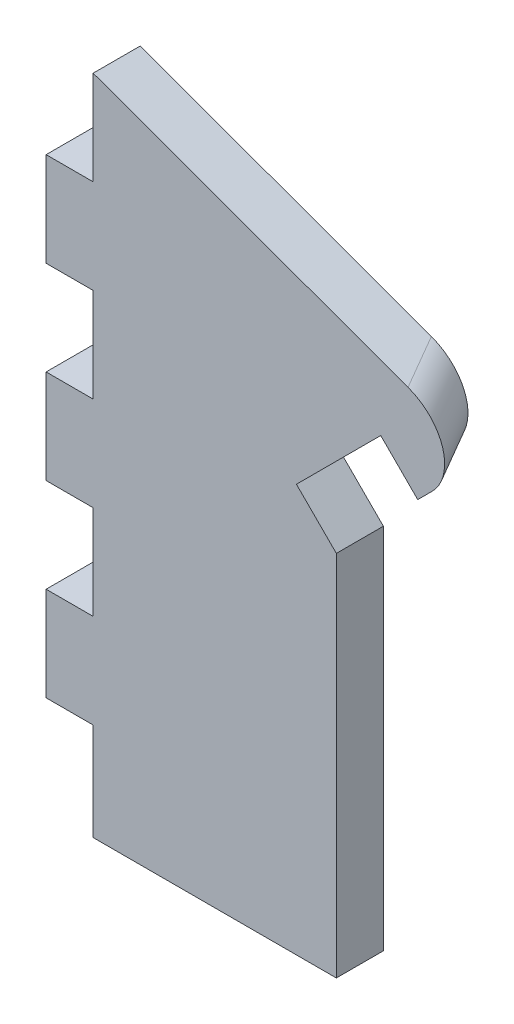
ISO-10303-21;
HEADER;
FILE_DESCRIPTION(('STEP AP214'),'2;1');
FILE_NAME('part.step','',(''),(''),'','','');
FILE_SCHEMA(('AUTOMOTIVE_DESIGN { 1 0 10303 214 1 1 1 1 }'));
ENDSEC;
DATA;
#1=APPLICATION_CONTEXT('core data for automotive mechanical design processes');
#2=APPLICATION_PROTOCOL_DEFINITION('international standard','automotive_design',2000,#1);
#3=PRODUCT_CONTEXT('',#1,'mechanical');
#4=PRODUCT('Part','Part','',(#3));
#5=PRODUCT_RELATED_PRODUCT_CATEGORY('part','',(#4));
#6=PRODUCT_DEFINITION_FORMATION('','',#4);
#7=PRODUCT_DEFINITION_CONTEXT('part definition',#1,'design');
#8=PRODUCT_DEFINITION('design','',#6,#7);
#9=PRODUCT_DEFINITION_SHAPE('','',#8);
#10=(LENGTH_UNIT() NAMED_UNIT(*) SI_UNIT(.MILLI.,.METRE.));
#11=(NAMED_UNIT(*) PLANE_ANGLE_UNIT() SI_UNIT($,.RADIAN.));
#12=(NAMED_UNIT(*) SI_UNIT($,.STERADIAN.) SOLID_ANGLE_UNIT());
#13=UNCERTAINTY_MEASURE_WITH_UNIT(LENGTH_MEASURE(1.E-05),#10,'distance_accuracy_value','');
#14=(GEOMETRIC_REPRESENTATION_CONTEXT(3) GLOBAL_UNCERTAINTY_ASSIGNED_CONTEXT((#13)) GLOBAL_UNIT_ASSIGNED_CONTEXT((#10,
#11,#12)) REPRESENTATION_CONTEXT('',''));
#15=CARTESIAN_POINT('',(0.,0.,0.));
#16=DIRECTION('',(0.,0.,1.));
#17=DIRECTION('',(1.,0.,0.));
#18=AXIS2_PLACEMENT_3D('',#15,#16,#17);
#19=CARTESIAN_POINT('',(0.,140.724589222245,10.));
#20=DIRECTION('',(0.,0.,-1.));
#21=DIRECTION('',(-1.,0.,0.));
#22=AXIS2_PLACEMENT_3D('',#19,#20,#21);
#23=PLANE('',#22);
#24=DIRECTION('',(-0.707020674127324,-0.707192877761467,0.));
#25=VECTOR('',#24,1.);
#26=CARTESIAN_POINT('',(61.5105859152018,79.2289813233183,10.));
#27=LINE('',#26,#25);
#28=CARTESIAN_POINT('',(82.0807535358215,99.8041590628056,10.));
#29=VERTEX_POINT('',#28);
#30=CARTESIAN_POINT('',(78.9949732784198,96.7176272254375,10.));
#31=VERTEX_POINT('',#30);
#32=EDGE_CURVE('E185',#29,#31,#27,.T.);
#33=ORIENTED_EDGE('',*,*,#32,.F.);
#34=CARTESIAN_POINT('',(73.5157746309853,106.964960125446,10.));
#35=DIRECTION('',(0.,0.,-1.));
#36=DIRECTION('',(-0.939692620785907,0.342020143325672,0.));
#37=AXIS2_PLACEMENT_3D('',#34,#35,#36);
#38=ELLIPSE('',#37,11.3486836050021,10.);
#39=CARTESIAN_POINT('',(76.935976064242,116.361886333305,10.));
#40=VERTEX_POINT('',#39);
#41=EDGE_CURVE('E55',#29,#40,#38,.F.);
#42=ORIENTED_EDGE('',*,*,#41,.T.);
#43=DIRECTION('',(0.939692620785907,-0.342020143325673,0.));
#44=VECTOR('',#43,1.);
#45=CARTESIAN_POINT('',(10.,140.724589222245,10.));
#46=LINE('',#45,#44);
#47=CARTESIAN_POINT('',(10.,140.724589222245,10.));
#48=VERTEX_POINT('',#47);
#49=EDGE_CURVE('E217',#48,#40,#46,.T.);
#50=ORIENTED_EDGE('',*,*,#49,.F.);
#51=DIRECTION('',(0.,1.,0.));
#52=VECTOR('',#51,1.);
#53=CARTESIAN_POINT('',(10.,120.724589222245,10.));
#54=LINE('',#53,#52);
#55=CARTESIAN_POINT('',(10.,120.724589222245,10.));
#56=VERTEX_POINT('',#55);
#57=EDGE_CURVE('E230',#56,#48,#54,.T.);
#58=ORIENTED_EDGE('',*,*,#57,.F.);
#59=DIRECTION('',(1.,0.,0.));
#60=VECTOR('',#59,1.);
#61=CARTESIAN_POINT('',(0.,120.724589222245,10.));
#62=LINE('',#61,#60);
#63=CARTESIAN_POINT('',(0.,120.724589222245,10.));
#64=VERTEX_POINT('',#63);
#65=EDGE_CURVE('E233',#64,#56,#62,.T.);
#66=ORIENTED_EDGE('',*,*,#65,.F.);
#67=DIRECTION('',(0.,-1.,0.));
#68=VECTOR('',#67,1.);
#69=CARTESIAN_POINT('',(0.,0.,10.));
#70=LINE('',#69,#68);
#71=CARTESIAN_POINT('',(0.,100.724589222245,10.));
#72=VERTEX_POINT('',#71);
#73=EDGE_CURVE('E313',#64,#72,#70,.T.);
#74=ORIENTED_EDGE('',*,*,#73,.T.);
#75=DIRECTION('',(-1.,0.,0.));
#76=VECTOR('',#75,1.);
#77=CARTESIAN_POINT('',(59.5721644797323,100.724589222245,10.));
#78=LINE('',#77,#76);
#79=CARTESIAN_POINT('',(10.,100.724589222245,10.));
#80=VERTEX_POINT('',#79);
#81=EDGE_CURVE('E271',#80,#72,#78,.T.);
#82=ORIENTED_EDGE('',*,*,#81,.F.);
#83=DIRECTION('',(0.,1.,0.));
#84=VECTOR('',#83,1.);
#85=CARTESIAN_POINT('',(10.,-73.1990088628228,10.));
#86=LINE('',#85,#84);
#87=CARTESIAN_POINT('',(10.,80.7245892222448,10.));
#88=VERTEX_POINT('',#87);
#89=EDGE_CURVE('E275',#88,#80,#86,.T.);
#90=ORIENTED_EDGE('',*,*,#89,.F.);
#91=DIRECTION('',(1.,0.,0.));
#92=VECTOR('',#91,1.);
#93=CARTESIAN_POINT('',(59.5721644797323,80.7245892222448,10.));
#94=LINE('',#93,#92);
#95=CARTESIAN_POINT('',(0.,80.7245892222448,10.));
#96=VERTEX_POINT('',#95);
#97=EDGE_CURVE('E268',#96,#88,#94,.T.);
#98=ORIENTED_EDGE('',*,*,#97,.F.);
#99=CARTESIAN_POINT('',(0.,60.7245892222449,10.));
#100=VERTEX_POINT('',#99);
#101=EDGE_CURVE('E316',#96,#100,#70,.T.);
#102=ORIENTED_EDGE('',*,*,#101,.T.);
#103=DIRECTION('',(-1.,0.,0.));
#104=VECTOR('',#103,1.);
#105=CARTESIAN_POINT('',(59.5721644797323,60.7245892222449,10.));
#106=LINE('',#105,#104);
#107=CARTESIAN_POINT('',(10.,60.7245892222448,10.));
#108=VERTEX_POINT('',#107);
#109=EDGE_CURVE('E299',#108,#100,#106,.T.);
#110=ORIENTED_EDGE('',*,*,#109,.F.);
#111=DIRECTION('',(0.,1.,0.));
#112=VECTOR('',#111,1.);
#113=CARTESIAN_POINT('',(10.,-73.1990088628228,10.));
#114=LINE('',#113,#112);
#115=CARTESIAN_POINT('',(10.,40.7245892222448,10.));
#116=VERTEX_POINT('',#115);
#117=EDGE_CURVE('E278',#116,#108,#114,.T.);
#118=ORIENTED_EDGE('',*,*,#117,.F.);
#119=DIRECTION('',(1.,0.,0.));
#120=VECTOR('',#119,1.);
#121=CARTESIAN_POINT('',(59.5721644797323,40.7245892222448,10.));
#122=LINE('',#121,#120);
#123=CARTESIAN_POINT('',(0.,40.7245892222448,10.));
#124=VERTEX_POINT('',#123);
#125=EDGE_CURVE('E290',#124,#116,#122,.T.);
#126=ORIENTED_EDGE('',*,*,#125,.F.);
#127=CARTESIAN_POINT('',(0.,20.7245892222448,10.));
#128=VERTEX_POINT('',#127);
#129=EDGE_CURVE('E317',#124,#128,#70,.T.);
#130=ORIENTED_EDGE('',*,*,#129,.T.);
#131=DIRECTION('',(1.,0.,0.));
#132=VECTOR('',#131,1.);
#133=CARTESIAN_POINT('',(59.5721644797322,20.7245892222448,10.));
#134=LINE('',#133,#132);
#135=CARTESIAN_POINT('',(10.,20.7245892222448,10.));
#136=VERTEX_POINT('',#135);
#137=EDGE_CURVE('E249',#128,#136,#134,.T.);
#138=ORIENTED_EDGE('',*,*,#137,.T.);
#139=DIRECTION('',(0.,-1.,0.));
#140=VECTOR('',#139,1.);
#141=CARTESIAN_POINT('',(10.,-73.1990088628228,10.));
#142=LINE('',#141,#140);
#143=CARTESIAN_POINT('',(10.,0.,10.));
#144=VERTEX_POINT('',#143);
#145=EDGE_CURVE('E252',#136,#144,#142,.T.);
#146=ORIENTED_EDGE('',*,*,#145,.T.);
#147=DIRECTION('',(1.,0.,0.));
#148=VECTOR('',#147,1.);
#149=CARTESIAN_POINT('',(0.,0.,10.));
#150=LINE('',#149,#148);
#151=CARTESIAN_POINT('',(61.6966708086558,0.,10.));
#152=VERTEX_POINT('',#151);
#153=EDGE_CURVE('E315',#144,#152,#150,.T.);
#154=ORIENTED_EDGE('',*,*,#153,.T.);
#155=DIRECTION('',(0.,-1.,0.));
#156=VECTOR('',#155,1.);
#157=CARTESIAN_POINT('',(61.6966708086558,78.1703480445436,10.));
#158=LINE('',#157,#156);
#159=CARTESIAN_POINT('',(61.6966708086558,78.1703480445436,10.));
#160=VERTEX_POINT('',#159);
#161=EDGE_CURVE('E210',#160,#152,#158,.T.);
#162=ORIENTED_EDGE('',*,*,#161,.F.);
#163=DIRECTION('',(0.707192877761467,-0.707020674127324,0.));
#164=VECTOR('',#163,1.);
#165=CARTESIAN_POINT('',(31.1419879340853,108.717590760147,10.));
#166=LINE('',#165,#164);
#167=CARTESIAN_POINT('',(53.2103562755182,86.6545961340715,10.));
#168=VERTEX_POINT('',#167);
#169=EDGE_CURVE('E205',#168,#160,#166,.T.);
#170=ORIENTED_EDGE('',*,*,#169,.F.);
#171=DIRECTION('',(0.707020674127323,0.707192877761467,0.));
#172=VECTOR('',#171,1.);
#173=CARTESIAN_POINT('',(53.2103562755182,86.6545961340715,10.));
#174=LINE('',#173,#172);
#175=CARTESIAN_POINT('',(71.1310404745797,104.579645137527,10.));
#176=VERTEX_POINT('',#175);
#177=EDGE_CURVE('E335',#168,#176,#174,.T.);
#178=ORIENTED_EDGE('',*,*,#177,.T.);
#179=DIRECTION('',(0.707192877761467,-0.707020674127324,0.));
#180=VECTOR('',#179,1.);
#181=CARTESIAN_POINT('',(49.0626721331468,126.642639763603,10.));
#182=LINE('',#181,#180);
#183=EDGE_CURVE('E200',#176,#31,#182,.T.);
#184=ORIENTED_EDGE('',*,*,#183,.T.);
#185=EDGE_LOOP('',(#33,#42,#50,#58,#66,#74,#82,#90,#98,#102,#110,#118,#126,#130,#138,#146,#154,
#162,#170,#178,#184));
#186=FACE_BOUND('',#185,.T.);
#187=ADVANCED_FACE('F33',(#186),#23,.F.);
#188=CARTESIAN_POINT('',(0.,140.724589222245,0.));
#189=DIRECTION('',(0.,0.,-1.));
#190=DIRECTION('',(-1.,0.,0.));
#191=AXIS2_PLACEMENT_3D('',#188,#189,#190);
#192=PLANE('',#191);
#193=DIRECTION('',(0.939692620785907,-0.342020143325673,0.));
#194=VECTOR('',#193,1.);
#195=CARTESIAN_POINT('',(10.,140.724589222245,0.));
#196=LINE('',#195,#194);
#197=CARTESIAN_POINT('',(10.,140.724589222245,0.));
#198=VERTEX_POINT('',#197);
#199=CARTESIAN_POINT('',(71.8937024804231,118.197123830842,0.));
#200=VERTEX_POINT('',#199);
#201=EDGE_CURVE('E220',#198,#200,#196,.T.);
#202=ORIENTED_EDGE('',*,*,#201,.T.);
#203=CARTESIAN_POINT('',(68.4735010471663,108.800197622983,0.));
#204=DIRECTION('',(0.,0.,-1.));
#205=DIRECTION('',(-0.939692620785907,0.342020143325672,0.));
#206=AXIS2_PLACEMENT_3D('',#203,#204,#205);
#207=ELLIPSE('',#206,11.3486836050021,10.);
#208=CARTESIAN_POINT('',(77.0384799520025,101.639396560342,0.));
#209=VERTEX_POINT('',#208);
#210=EDGE_CURVE('E11',#200,#209,#207,.T.);
#211=ORIENTED_EDGE('',*,*,#210,.T.);
#212=DIRECTION('',(-0.707020674127324,-0.707192877761467,0.));
#213=VECTOR('',#212,1.);
#214=CARTESIAN_POINT('',(58.071216422452,82.6675133190508,0.));
#215=LINE('',#214,#213);
#216=CARTESIAN_POINT('',(75.55560378567,100.15615922117,0.));
#217=VERTEX_POINT('',#216);
#218=EDGE_CURVE('E175',#209,#217,#215,.T.);
#219=ORIENTED_EDGE('',*,*,#218,.T.);
#220=DIRECTION('',(0.707192877761467,-0.707020674127324,0.));
#221=VECTOR('',#220,1.);
#222=CARTESIAN_POINT('',(49.0626721331468,126.642639763603,0.));
#223=LINE('',#222,#221);
#224=CARTESIAN_POINT('',(67.6916709818298,108.01817713326,0.));
#225=VERTEX_POINT('',#224);
#226=EDGE_CURVE('E180',#225,#217,#223,.T.);
#227=ORIENTED_EDGE('',*,*,#226,.F.);
#228=DIRECTION('',(-0.707020674127323,-0.707192877761467,0.));
#229=VECTOR('',#228,1.);
#230=CARTESIAN_POINT('',(49.7709867827684,90.093128129804,0.));
#231=LINE('',#230,#229);
#232=CARTESIAN_POINT('',(49.7709867827684,90.0931281298039,0.));
#233=VERTEX_POINT('',#232);
#234=EDGE_CURVE('E213',#225,#233,#231,.T.);
#235=ORIENTED_EDGE('',*,*,#234,.T.);
#236=DIRECTION('',(0.707192877761467,-0.707020674127324,0.));
#237=VECTOR('',#236,1.);
#238=CARTESIAN_POINT('',(31.1419879340853,108.717590760147,0.));
#239=LINE('',#238,#237);
#240=CARTESIAN_POINT('',(61.6966708086558,78.1703480445436,0.));
#241=VERTEX_POINT('',#240);
#242=EDGE_CURVE('E199',#233,#241,#239,.T.);
#243=ORIENTED_EDGE('',*,*,#242,.T.);
#244=DIRECTION('',(0.,1.,0.));
#245=VECTOR('',#244,1.);
#246=CARTESIAN_POINT('',(61.6966708086558,140.724589222245,0.));
#247=LINE('',#246,#245);
#248=CARTESIAN_POINT('',(61.6966708086558,0.,0.));
#249=VERTEX_POINT('',#248);
#250=EDGE_CURVE('E194',#249,#241,#247,.T.);
#251=ORIENTED_EDGE('',*,*,#250,.F.);
#252=DIRECTION('',(1.,0.,0.));
#253=VECTOR('',#252,1.);
#254=CARTESIAN_POINT('',(0.,0.,0.));
#255=LINE('',#254,#253);
#256=CARTESIAN_POINT('',(10.,0.,0.));
#257=VERTEX_POINT('',#256);
#258=EDGE_CURVE('E322',#257,#249,#255,.T.);
#259=ORIENTED_EDGE('',*,*,#258,.F.);
#260=DIRECTION('',(0.,-1.,0.));
#261=VECTOR('',#260,1.);
#262=CARTESIAN_POINT('',(10.,-73.1990088628228,0.));
#263=LINE('',#262,#261);
#264=CARTESIAN_POINT('',(10.,20.7245892222448,0.));
#265=VERTEX_POINT('',#264);
#266=EDGE_CURVE('E253',#265,#257,#263,.T.);
#267=ORIENTED_EDGE('',*,*,#266,.F.);
#268=DIRECTION('',(1.,0.,0.));
#269=VECTOR('',#268,1.);
#270=CARTESIAN_POINT('',(59.5721644797322,20.7245892222448,0.));
#271=LINE('',#270,#269);
#272=CARTESIAN_POINT('',(0.,20.7245892222448,0.));
#273=VERTEX_POINT('',#272);
#274=EDGE_CURVE('E244',#273,#265,#271,.T.);
#275=ORIENTED_EDGE('',*,*,#274,.F.);
#276=DIRECTION('',(0.,-1.,0.));
#277=VECTOR('',#276,1.);
#278=CARTESIAN_POINT('',(0.,0.,0.));
#279=LINE('',#278,#277);
#280=CARTESIAN_POINT('',(0.,40.7245892222448,0.));
#281=VERTEX_POINT('',#280);
#282=EDGE_CURVE('E306',#281,#273,#279,.T.);
#283=ORIENTED_EDGE('',*,*,#282,.F.);
#284=DIRECTION('',(1.,0.,0.));
#285=VECTOR('',#284,1.);
#286=CARTESIAN_POINT('',(59.5721644797323,40.7245892222448,0.));
#287=LINE('',#286,#285);
#288=CARTESIAN_POINT('',(10.,40.7245892222448,0.));
#289=VERTEX_POINT('',#288);
#290=EDGE_CURVE('E293',#281,#289,#287,.T.);
#291=ORIENTED_EDGE('',*,*,#290,.T.);
#292=DIRECTION('',(0.,1.,0.));
#293=VECTOR('',#292,1.);
#294=CARTESIAN_POINT('',(10.,-73.1990088628228,0.));
#295=LINE('',#294,#293);
#296=CARTESIAN_POINT('',(10.,60.7245892222448,0.));
#297=VERTEX_POINT('',#296);
#298=EDGE_CURVE('E286',#289,#297,#295,.T.);
#299=ORIENTED_EDGE('',*,*,#298,.T.);
#300=DIRECTION('',(-1.,0.,0.));
#301=VECTOR('',#300,1.);
#302=CARTESIAN_POINT('',(59.5721644797323,60.7245892222449,0.));
#303=LINE('',#302,#301);
#304=CARTESIAN_POINT('',(0.,60.7245892222449,0.));
#305=VERTEX_POINT('',#304);
#306=EDGE_CURVE('E289',#297,#305,#303,.T.);
#307=ORIENTED_EDGE('',*,*,#306,.T.);
#308=CARTESIAN_POINT('',(0.,80.7245892222448,0.));
#309=VERTEX_POINT('',#308);
#310=EDGE_CURVE('E323',#309,#305,#279,.T.);
#311=ORIENTED_EDGE('',*,*,#310,.F.);
#312=DIRECTION('',(1.,0.,0.));
#313=VECTOR('',#312,1.);
#314=CARTESIAN_POINT('',(59.5721644797323,80.7245892222448,0.));
#315=LINE('',#314,#313);
#316=CARTESIAN_POINT('',(10.,80.7245892222448,0.));
#317=VERTEX_POINT('',#316);
#318=EDGE_CURVE('E261',#309,#317,#315,.T.);
#319=ORIENTED_EDGE('',*,*,#318,.T.);
#320=DIRECTION('',(0.,1.,0.));
#321=VECTOR('',#320,1.);
#322=CARTESIAN_POINT('',(10.,-73.1990088628228,0.));
#323=LINE('',#322,#321);
#324=CARTESIAN_POINT('',(10.,100.724589222245,0.));
#325=VERTEX_POINT('',#324);
#326=EDGE_CURVE('E272',#317,#325,#323,.T.);
#327=ORIENTED_EDGE('',*,*,#326,.T.);
#328=DIRECTION('',(-1.,0.,0.));
#329=VECTOR('',#328,1.);
#330=CARTESIAN_POINT('',(59.5721644797323,100.724589222245,0.));
#331=LINE('',#330,#329);
#332=CARTESIAN_POINT('',(0.,100.724589222245,0.));
#333=VERTEX_POINT('',#332);
#334=EDGE_CURVE('E281',#325,#333,#331,.T.);
#335=ORIENTED_EDGE('',*,*,#334,.T.);
#336=CARTESIAN_POINT('',(0.,120.724589222245,0.));
#337=VERTEX_POINT('',#336);
#338=EDGE_CURVE('E320',#337,#333,#279,.T.);
#339=ORIENTED_EDGE('',*,*,#338,.F.);
#340=DIRECTION('',(1.,0.,0.));
#341=VECTOR('',#340,1.);
#342=CARTESIAN_POINT('',(0.,120.724589222245,0.));
#343=LINE('',#342,#341);
#344=CARTESIAN_POINT('',(10.,120.724589222245,0.));
#345=VERTEX_POINT('',#344);
#346=EDGE_CURVE('E234',#337,#345,#343,.T.);
#347=ORIENTED_EDGE('',*,*,#346,.T.);
#348=DIRECTION('',(0.,1.,0.));
#349=VECTOR('',#348,1.);
#350=CARTESIAN_POINT('',(10.,120.724589222245,0.));
#351=LINE('',#350,#349);
#352=EDGE_CURVE('E226',#345,#198,#351,.T.);
#353=ORIENTED_EDGE('',*,*,#352,.T.);
#354=EDGE_LOOP('',(#202,#211,#219,#227,#235,#243,#251,#259,#267,#275,#283,#291,#299,#307,#311,
#319,#327,#335,#339,#347,#353));
#355=FACE_BOUND('',#354,.T.);
#356=ADVANCED_FACE('F177',(#355),#192,.T.);
#357=CARTESIAN_POINT('',(10.,140.724589222245,0.));
#358=DIRECTION('',(-0.342020143325673,-0.939692620785907,0.));
#359=DIRECTION('',(0.939692620785907,-0.342020143325673,0.));
#360=AXIS2_PLACEMENT_3D('',#357,#358,#359);
#361=PLANE('',#360);
#362=ORIENTED_EDGE('',*,*,#49,.T.);
#363=DIRECTION('',(0.444304710512548,-0.161713689570831,0.881159467305294));
#364=VECTOR('',#363,1.);
#365=CARTESIAN_POINT('',(75.4503653391232,116.902604416955,7.05368877665366));
#366=LINE('',#365,#364);
#367=EDGE_CURVE('E41',#40,#200,#366,.F.);
#368=ORIENTED_EDGE('',*,*,#367,.T.);
#369=ORIENTED_EDGE('',*,*,#201,.F.);
#370=DIRECTION('',(0.,0.,1.));
#371=VECTOR('',#370,1.);
#372=CARTESIAN_POINT('',(10.,140.724589222245,0.));
#373=LINE('',#372,#371);
#374=EDGE_CURVE('E222',#198,#48,#373,.T.);
#375=ORIENTED_EDGE('',*,*,#374,.T.);
#376=EDGE_LOOP('',(#362,#368,#369,#375));
#377=FACE_BOUND('',#376,.T.);
#378=ADVANCED_FACE('F369',(#377),#361,.F.);
#379=CARTESIAN_POINT('',(49.0626721331468,126.642639763603,10.));
#380=DIRECTION('',(0.707020674127324,0.707192877761467,0.));
#381=DIRECTION('',(-0.707192877761467,0.707020674127324,0.));
#382=AXIS2_PLACEMENT_3D('',#379,#380,#381);
#383=PLANE('',#382);
#384=DIRECTION('',(-0.309297862778658,0.309222547800696,-0.89928652164491));
#385=VECTOR('',#384,1.);
#386=CARTESIAN_POINT('',(73.2694104097233,102.44179590202,-6.64712930892142));
#387=LINE('',#386,#385);
#388=EDGE_CURVE('E188',#31,#217,#387,.T.);
#389=ORIENTED_EDGE('',*,*,#388,.F.);
#390=ORIENTED_EDGE('',*,*,#183,.F.);
#391=DIRECTION('',(-0.309297862778658,0.309222547800696,-0.89928652164491));
#392=VECTOR('',#391,1.);
#393=CARTESIAN_POINT('',(66.9097201779816,108.79993752969,-2.27352951026813));
#394=LINE('',#393,#392);
#395=EDGE_CURVE('E198',#176,#225,#394,.T.);
#396=ORIENTED_EDGE('',*,*,#395,.T.);
#397=ORIENTED_EDGE('',*,*,#226,.T.);
#398=EDGE_LOOP('',(#389,#390,#396,#397));
#399=FACE_BOUND('',#398,.T.);
#400=ADVANCED_FACE('F197',(#399),#383,.F.);
#401=CARTESIAN_POINT('',(0.,0.,10.));
#402=DIRECTION('',(1.,0.,0.));
#403=DIRECTION('',(0.,0.,-1.));
#404=AXIS2_PLACEMENT_3D('',#401,#402,#403);
#405=PLANE('',#404);
#406=DIRECTION('',(0.,0.,1.));
#407=VECTOR('',#406,1.);
#408=CARTESIAN_POINT('',(0.,20.7245892222448,0.));
#409=LINE('',#408,#407);
#410=EDGE_CURVE('E245',#273,#128,#409,.T.);
#411=ORIENTED_EDGE('',*,*,#410,.T.);
#412=ORIENTED_EDGE('',*,*,#129,.F.);
#413=DIRECTION('',(0.,0.,1.));
#414=VECTOR('',#413,1.);
#415=CARTESIAN_POINT('',(0.,40.7245892222448,0.));
#416=LINE('',#415,#414);
#417=EDGE_CURVE('E307',#281,#124,#416,.T.);
#418=ORIENTED_EDGE('',*,*,#417,.F.);
#419=ORIENTED_EDGE('',*,*,#282,.T.);
#420=EDGE_LOOP('',(#411,#412,#418,#419));
#421=FACE_BOUND('',#420,.T.);
#422=ADVANCED_FACE('F377',(#421),#405,.F.);
#423=CARTESIAN_POINT('',(0.,0.,10.));
#424=DIRECTION('',(0.,1.,0.));
#425=DIRECTION('',(0.,0.,1.));
#426=AXIS2_PLACEMENT_3D('',#423,#424,#425);
#427=PLANE('',#426);
#428=ORIENTED_EDGE('',*,*,#258,.T.);
#429=DIRECTION('',(0.,0.,1.));
#430=VECTOR('',#429,1.);
#431=CARTESIAN_POINT('',(61.6966708086558,0.,-140.));
#432=LINE('',#431,#430);
#433=EDGE_CURVE('E214',#249,#152,#432,.T.);
#434=ORIENTED_EDGE('',*,*,#433,.T.);
#435=ORIENTED_EDGE('',*,*,#153,.F.);
#436=DIRECTION('',(0.,0.,1.));
#437=VECTOR('',#436,1.);
#438=CARTESIAN_POINT('',(10.,0.,0.));
#439=LINE('',#438,#437);
#440=EDGE_CURVE('E237',#257,#144,#439,.T.);
#441=ORIENTED_EDGE('',*,*,#440,.F.);
#442=EDGE_LOOP('',(#428,#434,#435,#441));
#443=FACE_BOUND('',#442,.T.);
#444=ADVANCED_FACE('F348',(#443),#427,.F.);
#445=ORIENTED_EDGE('',*,*,#101,.F.);
#446=DIRECTION('',(0.,0.,1.));
#447=VECTOR('',#446,1.);
#448=CARTESIAN_POINT('',(0.,80.7245892222448,0.));
#449=LINE('',#448,#447);
#450=EDGE_CURVE('E265',#309,#96,#449,.T.);
#451=ORIENTED_EDGE('',*,*,#450,.F.);
#452=ORIENTED_EDGE('',*,*,#310,.T.);
#453=DIRECTION('',(0.,0.,1.));
#454=VECTOR('',#453,1.);
#455=CARTESIAN_POINT('',(0.,60.7245892222449,0.));
#456=LINE('',#455,#454);
#457=EDGE_CURVE('E309',#305,#100,#456,.T.);
#458=ORIENTED_EDGE('',*,*,#457,.T.);
#459=EDGE_LOOP('',(#445,#451,#452,#458));
#460=FACE_BOUND('',#459,.T.);
#461=ADVANCED_FACE('F376',(#460),#405,.F.);
#462=ORIENTED_EDGE('',*,*,#73,.F.);
#463=DIRECTION('',(0.,0.,1.));
#464=VECTOR('',#463,1.);
#465=CARTESIAN_POINT('',(0.,120.724589222245,0.));
#466=LINE('',#465,#464);
#467=EDGE_CURVE('E224',#337,#64,#466,.T.);
#468=ORIENTED_EDGE('',*,*,#467,.F.);
#469=ORIENTED_EDGE('',*,*,#338,.T.);
#470=DIRECTION('',(0.,0.,1.));
#471=VECTOR('',#470,1.);
#472=CARTESIAN_POINT('',(0.,100.724589222245,0.));
#473=LINE('',#472,#471);
#474=EDGE_CURVE('E262',#333,#72,#473,.T.);
#475=ORIENTED_EDGE('',*,*,#474,.T.);
#476=EDGE_LOOP('',(#462,#468,#469,#475));
#477=FACE_BOUND('',#476,.T.);
#478=ADVANCED_FACE('F378',(#477),#405,.F.);
#479=CARTESIAN_POINT('',(10.,-73.1990088628228,0.));
#480=DIRECTION('',(1.,0.,0.));
#481=DIRECTION('',(0.,1.,0.));
#482=AXIS2_PLACEMENT_3D('',#479,#480,#481);
#483=PLANE('',#482);
#484=ORIENTED_EDGE('',*,*,#117,.T.);
#485=DIRECTION('',(0.,0.,1.));
#486=VECTOR('',#485,1.);
#487=CARTESIAN_POINT('',(10.,60.7245892222448,0.));
#488=LINE('',#487,#486);
#489=EDGE_CURVE('E296',#297,#108,#488,.T.);
#490=ORIENTED_EDGE('',*,*,#489,.F.);
#491=ORIENTED_EDGE('',*,*,#298,.F.);
#492=DIRECTION('',(0.,0.,1.));
#493=VECTOR('',#492,1.);
#494=CARTESIAN_POINT('',(10.,40.7245892222448,0.));
#495=LINE('',#494,#493);
#496=EDGE_CURVE('E304',#289,#116,#495,.T.);
#497=ORIENTED_EDGE('',*,*,#496,.T.);
#498=EDGE_LOOP('',(#484,#490,#491,#497));
#499=FACE_BOUND('',#498,.T.);
#500=ADVANCED_FACE('F372',(#499),#483,.F.);
#501=CARTESIAN_POINT('',(59.5721644797323,40.7245892222448,0.));
#502=DIRECTION('',(0.,-1.,0.));
#503=DIRECTION('',(0.,0.,-1.));
#504=AXIS2_PLACEMENT_3D('',#501,#502,#503);
#505=PLANE('',#504);
#506=ORIENTED_EDGE('',*,*,#125,.T.);
#507=ORIENTED_EDGE('',*,*,#496,.F.);
#508=ORIENTED_EDGE('',*,*,#290,.F.);
#509=ORIENTED_EDGE('',*,*,#417,.T.);
#510=EDGE_LOOP('',(#506,#507,#508,#509));
#511=FACE_BOUND('',#510,.T.);
#512=ADVANCED_FACE('F385',(#511),#505,.F.);
#513=CARTESIAN_POINT('',(59.5721644797323,60.7245892222449,0.));
#514=DIRECTION('',(0.,1.,0.));
#515=DIRECTION('',(0.,0.,1.));
#516=AXIS2_PLACEMENT_3D('',#513,#514,#515);
#517=PLANE('',#516);
#518=ORIENTED_EDGE('',*,*,#109,.T.);
#519=ORIENTED_EDGE('',*,*,#457,.F.);
#520=ORIENTED_EDGE('',*,*,#306,.F.);
#521=ORIENTED_EDGE('',*,*,#489,.T.);
#522=EDGE_LOOP('',(#518,#519,#520,#521));
#523=FACE_BOUND('',#522,.T.);
#524=ADVANCED_FACE('F409',(#523),#517,.F.);
#525=CARTESIAN_POINT('',(10.,-73.1990088628228,0.));
#526=DIRECTION('',(1.,0.,0.));
#527=DIRECTION('',(0.,1.,0.));
#528=AXIS2_PLACEMENT_3D('',#525,#526,#527);
#529=PLANE('',#528);
#530=ORIENTED_EDGE('',*,*,#89,.T.);
#531=DIRECTION('',(0.,0.,1.));
#532=VECTOR('',#531,1.);
#533=CARTESIAN_POINT('',(10.,100.724589222245,0.));
#534=LINE('',#533,#532);
#535=EDGE_CURVE('E259',#325,#80,#534,.T.);
#536=ORIENTED_EDGE('',*,*,#535,.F.);
#537=ORIENTED_EDGE('',*,*,#326,.F.);
#538=DIRECTION('',(0.,0.,1.));
#539=VECTOR('',#538,1.);
#540=CARTESIAN_POINT('',(10.,80.7245892222448,0.));
#541=LINE('',#540,#539);
#542=EDGE_CURVE('E256',#317,#88,#541,.T.);
#543=ORIENTED_EDGE('',*,*,#542,.T.);
#544=EDGE_LOOP('',(#530,#536,#537,#543));
#545=FACE_BOUND('',#544,.T.);
#546=ADVANCED_FACE('F434',(#545),#529,.F.);
#547=CARTESIAN_POINT('',(59.5721644797323,80.7245892222448,0.));
#548=DIRECTION('',(0.,-1.,0.));
#549=DIRECTION('',(0.,0.,-1.));
#550=AXIS2_PLACEMENT_3D('',#547,#548,#549);
#551=PLANE('',#550);
#552=ORIENTED_EDGE('',*,*,#97,.T.);
#553=ORIENTED_EDGE('',*,*,#542,.F.);
#554=ORIENTED_EDGE('',*,*,#318,.F.);
#555=ORIENTED_EDGE('',*,*,#450,.T.);
#556=EDGE_LOOP('',(#552,#553,#554,#555));
#557=FACE_BOUND('',#556,.T.);
#558=ADVANCED_FACE('F428',(#557),#551,.F.);
#559=CARTESIAN_POINT('',(59.5721644797323,100.724589222245,0.));
#560=DIRECTION('',(0.,1.,0.));
#561=DIRECTION('',(0.,0.,1.));
#562=AXIS2_PLACEMENT_3D('',#559,#560,#561);
#563=PLANE('',#562);
#564=ORIENTED_EDGE('',*,*,#81,.T.);
#565=ORIENTED_EDGE('',*,*,#474,.F.);
#566=ORIENTED_EDGE('',*,*,#334,.F.);
#567=ORIENTED_EDGE('',*,*,#535,.T.);
#568=EDGE_LOOP('',(#564,#565,#566,#567));
#569=FACE_BOUND('',#568,.T.);
#570=ADVANCED_FACE('F420',(#569),#563,.F.);
#571=CARTESIAN_POINT('',(10.,-73.1990088628228,0.));
#572=DIRECTION('',(-1.,0.,0.));
#573=DIRECTION('',(0.,-1.,0.));
#574=AXIS2_PLACEMENT_3D('',#571,#572,#573);
#575=PLANE('',#574);
#576=ORIENTED_EDGE('',*,*,#145,.F.);
#577=DIRECTION('',(0.,0.,1.));
#578=VECTOR('',#577,1.);
#579=CARTESIAN_POINT('',(10.,20.7245892222448,0.));
#580=LINE('',#579,#578);
#581=EDGE_CURVE('E242',#265,#136,#580,.T.);
#582=ORIENTED_EDGE('',*,*,#581,.F.);
#583=ORIENTED_EDGE('',*,*,#266,.T.);
#584=ORIENTED_EDGE('',*,*,#440,.T.);
#585=EDGE_LOOP('',(#576,#582,#583,#584));
#586=FACE_BOUND('',#585,.T.);
#587=ADVANCED_FACE('F418',(#586),#575,.T.);
#588=CARTESIAN_POINT('',(59.5721644797322,20.7245892222448,0.));
#589=DIRECTION('',(0.,-1.,0.));
#590=DIRECTION('',(1.,0.,0.));
#591=AXIS2_PLACEMENT_3D('',#588,#589,#590);
#592=PLANE('',#591);
#593=ORIENTED_EDGE('',*,*,#137,.F.);
#594=ORIENTED_EDGE('',*,*,#410,.F.);
#595=ORIENTED_EDGE('',*,*,#274,.T.);
#596=ORIENTED_EDGE('',*,*,#581,.T.);
#597=EDGE_LOOP('',(#593,#594,#595,#596));
#598=FACE_BOUND('',#597,.T.);
#599=ADVANCED_FACE('F415',(#598),#592,.T.);
#600=CARTESIAN_POINT('',(10.,120.724589222245,0.));
#601=DIRECTION('',(1.,0.,0.));
#602=DIRECTION('',(0.,1.,0.));
#603=AXIS2_PLACEMENT_3D('',#600,#601,#602);
#604=PLANE('',#603);
#605=ORIENTED_EDGE('',*,*,#57,.T.);
#606=ORIENTED_EDGE('',*,*,#374,.F.);
#607=ORIENTED_EDGE('',*,*,#352,.F.);
#608=DIRECTION('',(0.,0.,1.));
#609=VECTOR('',#608,1.);
#610=CARTESIAN_POINT('',(10.,120.724589222245,0.));
#611=LINE('',#610,#609);
#612=EDGE_CURVE('E227',#345,#56,#611,.T.);
#613=ORIENTED_EDGE('',*,*,#612,.T.);
#614=EDGE_LOOP('',(#605,#606,#607,#613));
#615=FACE_BOUND('',#614,.T.);
#616=ADVANCED_FACE('F426',(#615),#604,.F.);
#617=CARTESIAN_POINT('',(0.,120.724589222245,0.));
#618=DIRECTION('',(0.,-1.,0.));
#619=DIRECTION('',(0.,0.,-1.));
#620=AXIS2_PLACEMENT_3D('',#617,#618,#619);
#621=PLANE('',#620);
#622=ORIENTED_EDGE('',*,*,#65,.T.);
#623=ORIENTED_EDGE('',*,*,#612,.F.);
#624=ORIENTED_EDGE('',*,*,#346,.F.);
#625=ORIENTED_EDGE('',*,*,#467,.T.);
#626=EDGE_LOOP('',(#622,#623,#624,#625));
#627=FACE_BOUND('',#626,.T.);
#628=ADVANCED_FACE('F477',(#627),#621,.F.);
#629=CARTESIAN_POINT('',(61.6966708086558,78.1703480445436,-140.));
#630=DIRECTION('',(-1.,0.,0.));
#631=DIRECTION('',(0.,-1.,0.));
#632=AXIS2_PLACEMENT_3D('',#629,#630,#631);
#633=PLANE('',#632);
#634=ORIENTED_EDGE('',*,*,#250,.T.);
#635=DIRECTION('',(0.,0.,1.));
#636=VECTOR('',#635,1.);
#637=CARTESIAN_POINT('',(61.6966708086558,78.1703480445436,-140.));
#638=LINE('',#637,#636);
#639=EDGE_CURVE('E212',#241,#160,#638,.T.);
#640=ORIENTED_EDGE('',*,*,#639,.T.);
#641=ORIENTED_EDGE('',*,*,#161,.T.);
#642=ORIENTED_EDGE('',*,*,#433,.F.);
#643=EDGE_LOOP('',(#634,#640,#641,#642));
#644=FACE_BOUND('',#643,.T.);
#645=ADVANCED_FACE('F345',(#644),#633,.F.);
#646=CARTESIAN_POINT('',(31.1419879340853,108.717590760147,10.));
#647=DIRECTION('',(-0.707020674127324,-0.707192877761467,0.));
#648=DIRECTION('',(0.707192877761467,-0.707020674127324,0.));
#649=AXIS2_PLACEMENT_3D('',#646,#647,#648);
#650=PLANE('',#649);
#651=DIRECTION('',(0.309297862778658,-0.309222547800696,0.89928652164491));
#652=VECTOR('',#651,1.);
#653=CARTESIAN_POINT('',(48.9890359789202,90.8748885262338,-2.27352951026813));
#654=LINE('',#653,#652);
#655=EDGE_CURVE('E203',#233,#168,#654,.T.);
#656=ORIENTED_EDGE('',*,*,#655,.T.);
#657=ORIENTED_EDGE('',*,*,#169,.T.);
#658=ORIENTED_EDGE('',*,*,#639,.F.);
#659=ORIENTED_EDGE('',*,*,#242,.F.);
#660=EDGE_LOOP('',(#656,#657,#658,#659));
#661=FACE_BOUND('',#660,.T.);
#662=ADVANCED_FACE('F340',(#661),#650,.F.);
#663=CARTESIAN_POINT('',(241.768645895814,-65.5187582887033,505.407022072964));
#664=DIRECTION('',(0.635969023174164,-0.635814162767,-0.437359979865327));
#665=DIRECTION('',(-0.462207508887744,-0.767668697142006,0.443902005127349));
#666=AXIS2_PLACEMENT_3D('',#663,#664,#665);
#667=PLANE('',#666);
#668=ORIENTED_EDGE('',*,*,#655,.F.);
#669=ORIENTED_EDGE('',*,*,#234,.F.);
#670=ORIENTED_EDGE('',*,*,#395,.F.);
#671=ORIENTED_EDGE('',*,*,#177,.F.);
#672=EDGE_LOOP('',(#668,#669,#670,#671));
#673=FACE_BOUND('',#672,.T.);
#674=ADVANCED_FACE('F353',(#673),#667,.T.);
#675=CARTESIAN_POINT('',(76.9294081293751,89.3133626593692,17.7604284390278));
#676=DIRECTION('',(0.635969023174163,-0.635814162767,-0.437359979865327));
#677=DIRECTION('',(0.707020674127324,0.707192877761467,0.));
#678=AXIS2_PLACEMENT_3D('',#675,#676,#677);
#679=PLANE('',#678);
#680=ORIENTED_EDGE('',*,*,#218,.F.);
#681=DIRECTION('',(0.444304710512548,-0.161713689570831,0.881159467305294));
#682=VECTOR('',#681,1.);
#683=CARTESIAN_POINT('',(83.432127721427,99.3122990838894,12.6800889780004));
#684=LINE('',#683,#682);
#685=EDGE_CURVE('E193',#209,#29,#684,.T.);
#686=ORIENTED_EDGE('',*,*,#685,.T.);
#687=ORIENTED_EDGE('',*,*,#32,.T.);
#688=ORIENTED_EDGE('',*,*,#388,.T.);
#689=EDGE_LOOP('',(#680,#686,#687,#688));
#690=FACE_BOUND('',#689,.T.);
#691=ADVANCED_FACE('F189',(#690),#679,.T.);
#692=CARTESIAN_POINT('',(78.4961520281685,105.152250997459,19.8772454814146));
#693=DIRECTION('',(-0.444304710512548,0.161713689570831,-0.881159467305294));
#694=DIRECTION('',(-0.892912229446179,0.,0.450230774720537));
#695=AXIS2_PLACEMENT_3D('',#692,#693,#694);
#696=CYLINDRICAL_SURFACE('',#695,10.);
#697=ORIENTED_EDGE('',*,*,#210,.F.);
#698=ORIENTED_EDGE('',*,*,#367,.F.);
#699=ORIENTED_EDGE('',*,*,#41,.F.);
#700=ORIENTED_EDGE('',*,*,#685,.F.);
#701=EDGE_LOOP('',(#697,#698,#699,#700));
#702=FACE_BOUND('',#701,.T.);
#703=ADVANCED_FACE('F35',(#702),#696,.T.);
#704=CLOSED_SHELL('',(#187,#356,#378,#400,#422,#444,#461,#478,#500,#512,#524,#546,#558,#570,
#587,#599,#616,#628,#645,#662,#674,#691,#703));
#705=MANIFOLD_SOLID_BREP('B2',#704);
#706=ADVANCED_BREP_SHAPE_REPRESENTATION('',(#18,#705),#14);
#707=SHAPE_DEFINITION_REPRESENTATION(#9,#706);
ENDSEC;
END-ISO-10303-21;
